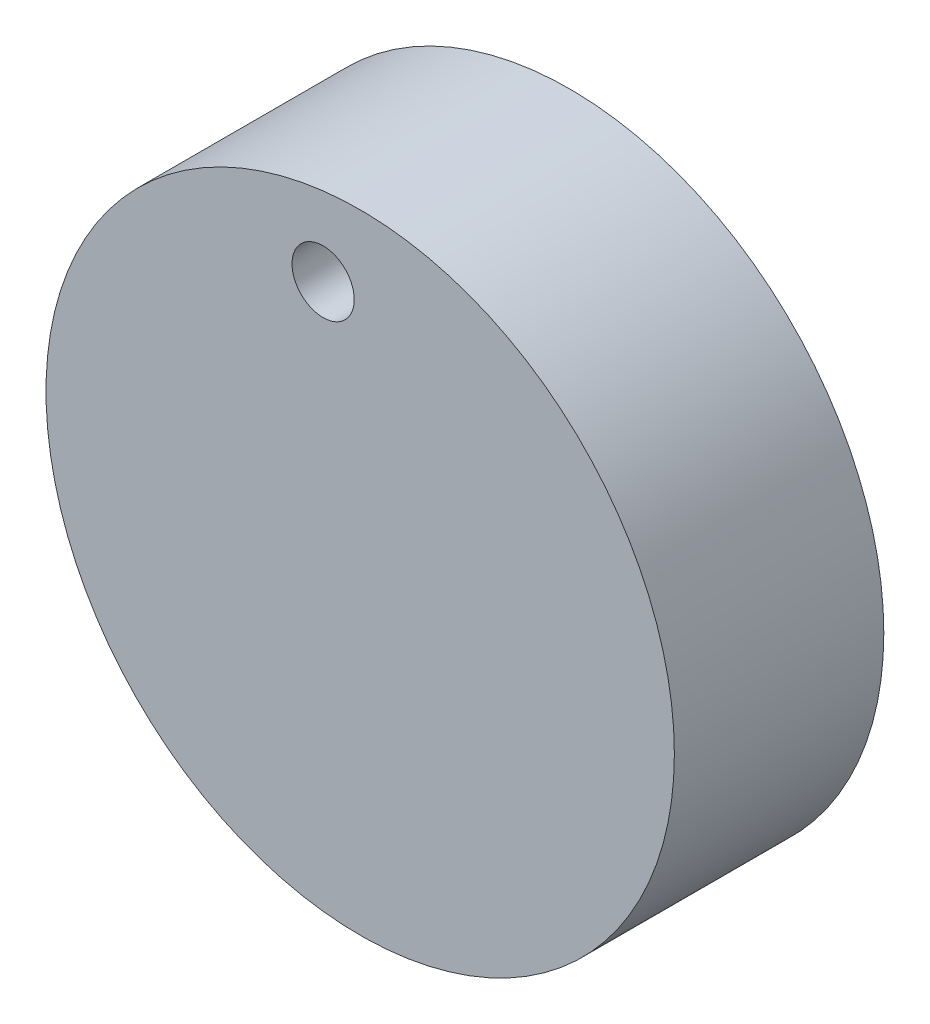
ISO-10303-21;
HEADER;
FILE_DESCRIPTION(('STEP AP214'),'2;1');
FILE_NAME('part.step','',(''),(''),'','','');
FILE_SCHEMA(('AUTOMOTIVE_DESIGN { 1 0 10303 214 1 1 1 1 }'));
ENDSEC;
DATA;
#1=APPLICATION_CONTEXT('core data for automotive mechanical design processes');
#2=APPLICATION_PROTOCOL_DEFINITION('international standard','automotive_design',2000,#1);
#3=PRODUCT_CONTEXT('',#1,'mechanical');
#4=PRODUCT('Part','Part','',(#3));
#5=PRODUCT_RELATED_PRODUCT_CATEGORY('part','',(#4));
#6=PRODUCT_DEFINITION_FORMATION('','',#4);
#7=PRODUCT_DEFINITION_CONTEXT('part definition',#1,'design');
#8=PRODUCT_DEFINITION('design','',#6,#7);
#9=PRODUCT_DEFINITION_SHAPE('','',#8);
#10=(LENGTH_UNIT() NAMED_UNIT(*) SI_UNIT(.MILLI.,.METRE.));
#11=(NAMED_UNIT(*) PLANE_ANGLE_UNIT() SI_UNIT($,.RADIAN.));
#12=(NAMED_UNIT(*) SI_UNIT($,.STERADIAN.) SOLID_ANGLE_UNIT());
#13=UNCERTAINTY_MEASURE_WITH_UNIT(LENGTH_MEASURE(1.E-05),#10,'distance_accuracy_value','');
#14=(GEOMETRIC_REPRESENTATION_CONTEXT(3) GLOBAL_UNCERTAINTY_ASSIGNED_CONTEXT((#13)) GLOBAL_UNIT_ASSIGNED_CONTEXT((#10,
#11,#12)) REPRESENTATION_CONTEXT('',''));
#15=CARTESIAN_POINT('',(0.,0.,0.));
#16=DIRECTION('',(0.,0.,1.));
#17=DIRECTION('',(1.,0.,0.));
#18=AXIS2_PLACEMENT_3D('',#15,#16,#17);
#19=CARTESIAN_POINT('',(0.,0.,6.));
#20=DIRECTION('',(0.,0.,-1.));
#21=DIRECTION('',(-1.,0.,0.));
#22=AXIS2_PLACEMENT_3D('',#19,#20,#21);
#23=CYLINDRICAL_SURFACE('',#22,9.);
#24=CARTESIAN_POINT('',(0.,0.,6.));
#25=DIRECTION('',(0.,0.,1.));
#26=DIRECTION('',(1.,0.,0.));
#27=AXIS2_PLACEMENT_3D('',#24,#25,#26);
#28=CIRCLE('',#27,9.);
#29=CARTESIAN_POINT('',(9.,0.,6.));
#30=VERTEX_POINT('',#29);
#31=EDGE_CURVE('E10',#30,#30,#28,.T.);
#32=ORIENTED_EDGE('',*,*,#31,.F.);
#33=EDGE_LOOP('',(#32));
#34=FACE_BOUND('',#33,.T.);
#35=CARTESIAN_POINT('',(0.,0.,0.));
#36=DIRECTION('',(0.,0.,1.));
#37=DIRECTION('',(1.,0.,0.));
#38=AXIS2_PLACEMENT_3D('',#35,#36,#37);
#39=CIRCLE('',#38,9.);
#40=CARTESIAN_POINT('',(9.,0.,0.));
#41=VERTEX_POINT('',#40);
#42=EDGE_CURVE('E32',#41,#41,#39,.T.);
#43=ORIENTED_EDGE('',*,*,#42,.T.);
#44=EDGE_LOOP('',(#43));
#45=FACE_BOUND('',#44,.T.);
#46=ADVANCED_FACE('F29',(#34,#45),#23,.T.);
#47=CARTESIAN_POINT('',(0.,0.,6.));
#48=DIRECTION('',(0.,0.,1.));
#49=DIRECTION('',(1.,0.,0.));
#50=AXIS2_PLACEMENT_3D('',#47,#48,#49);
#51=PLANE('',#50);
#52=CARTESIAN_POINT('',(-1.06184507689022,6.68391806578938,6.));
#53=DIRECTION('',(0.,0.,1.));
#54=DIRECTION('',(1.,0.,0.));
#55=AXIS2_PLACEMENT_3D('',#52,#53,#54);
#56=CIRCLE('',#55,0.891442853800639);
#57=CARTESIAN_POINT('',(-0.170402223089583,6.68391806578938,6.));
#58=VERTEX_POINT('',#57);
#59=EDGE_CURVE('E41',#58,#58,#56,.T.);
#60=ORIENTED_EDGE('',*,*,#59,.F.);
#61=EDGE_LOOP('',(#60));
#62=FACE_BOUND('',#61,.T.);
#63=ORIENTED_EDGE('',*,*,#31,.T.);
#64=EDGE_LOOP('',(#63));
#65=FACE_BOUND('',#64,.T.);
#66=ADVANCED_FACE('F56',(#62,#65),#51,.T.);
#67=CARTESIAN_POINT('',(0.,0.,0.));
#68=DIRECTION('',(0.,0.,1.));
#69=DIRECTION('',(1.,0.,0.));
#70=AXIS2_PLACEMENT_3D('',#67,#68,#69);
#71=PLANE('',#70);
#72=CARTESIAN_POINT('',(-1.06184507689022,6.68391806578938,0.));
#73=DIRECTION('',(0.,0.,1.));
#74=DIRECTION('',(1.,0.,0.));
#75=AXIS2_PLACEMENT_3D('',#72,#73,#74);
#76=CIRCLE('',#75,0.891442853800639);
#77=CARTESIAN_POINT('',(-0.170402223089583,6.68391806578938,0.));
#78=VERTEX_POINT('',#77);
#79=EDGE_CURVE('E39',#78,#78,#76,.T.);
#80=ORIENTED_EDGE('',*,*,#79,.T.);
#81=EDGE_LOOP('',(#80));
#82=FACE_BOUND('',#81,.T.);
#83=ORIENTED_EDGE('',*,*,#42,.F.);
#84=EDGE_LOOP('',(#83));
#85=FACE_BOUND('',#84,.T.);
#86=ADVANCED_FACE('F47',(#82,#85),#71,.F.);
#87=CARTESIAN_POINT('',(-1.06184507689022,6.68391806578938,0.));
#88=DIRECTION('',(0.,0.,1.));
#89=DIRECTION('',(1.,0.,0.));
#90=AXIS2_PLACEMENT_3D('',#87,#88,#89);
#91=CYLINDRICAL_SURFACE('',#90,0.891442853800639);
#92=ORIENTED_EDGE('',*,*,#79,.F.);
#93=EDGE_LOOP('',(#92));
#94=FACE_BOUND('',#93,.T.);
#95=ORIENTED_EDGE('',*,*,#59,.T.);
#96=EDGE_LOOP('',(#95));
#97=FACE_BOUND('',#96,.T.);
#98=ADVANCED_FACE('F50',(#94,#97),#91,.F.);
#99=CLOSED_SHELL('',(#46,#66,#86,#98));
#100=MANIFOLD_SOLID_BREP('B2',#99);
#101=ADVANCED_BREP_SHAPE_REPRESENTATION('',(#18,#100),#14);
#102=SHAPE_DEFINITION_REPRESENTATION(#9,#101);
ENDSEC;
END-ISO-10303-21;
